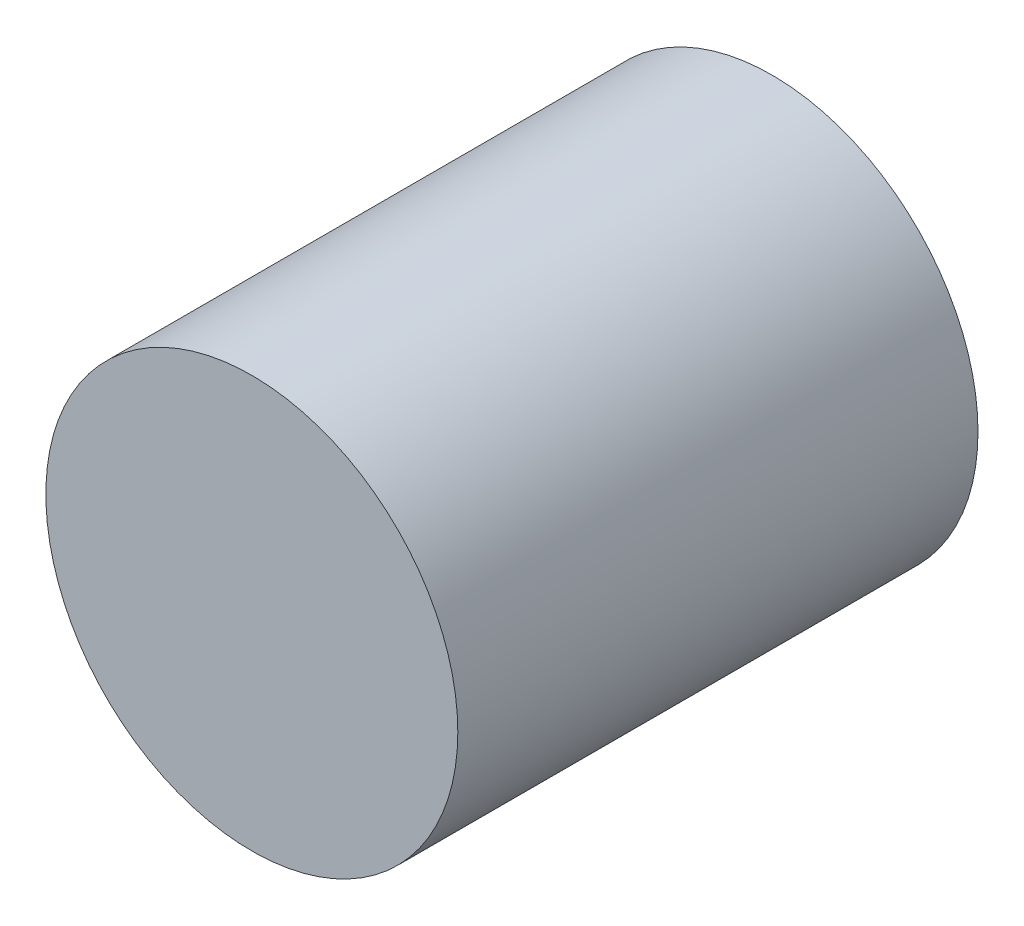
ISO-10303-21;
HEADER;
FILE_DESCRIPTION(('STEP AP214'),'2;1');
FILE_NAME('part.step','',(''),(''),'','','');
FILE_SCHEMA(('AUTOMOTIVE_DESIGN { 1 0 10303 214 1 1 1 1 }'));
ENDSEC;
DATA;
#1=APPLICATION_CONTEXT('core data for automotive mechanical design processes');
#2=APPLICATION_PROTOCOL_DEFINITION('international standard','automotive_design',2000,#1);
#3=PRODUCT_CONTEXT('',#1,'mechanical');
#4=PRODUCT('Part','Part','',(#3));
#5=PRODUCT_RELATED_PRODUCT_CATEGORY('part','',(#4));
#6=PRODUCT_DEFINITION_FORMATION('','',#4);
#7=PRODUCT_DEFINITION_CONTEXT('part definition',#1,'design');
#8=PRODUCT_DEFINITION('design','',#6,#7);
#9=PRODUCT_DEFINITION_SHAPE('','',#8);
#10=(LENGTH_UNIT() NAMED_UNIT(*) SI_UNIT(.MILLI.,.METRE.));
#11=(NAMED_UNIT(*) PLANE_ANGLE_UNIT() SI_UNIT($,.RADIAN.));
#12=(NAMED_UNIT(*) SI_UNIT($,.STERADIAN.) SOLID_ANGLE_UNIT());
#13=UNCERTAINTY_MEASURE_WITH_UNIT(LENGTH_MEASURE(1.E-05),#10,'distance_accuracy_value','');
#14=(GEOMETRIC_REPRESENTATION_CONTEXT(3) GLOBAL_UNCERTAINTY_ASSIGNED_CONTEXT((#13)) GLOBAL_UNIT_ASSIGNED_CONTEXT((#10,
#11,#12)) REPRESENTATION_CONTEXT('',''));
#15=CARTESIAN_POINT('',(0.,0.,0.));
#16=DIRECTION('',(0.,0.,1.));
#17=DIRECTION('',(1.,0.,0.));
#18=AXIS2_PLACEMENT_3D('',#15,#16,#17);
#19=CARTESIAN_POINT('',(0.,0.,20.));
#20=DIRECTION('',(0.,0.,-1.));
#21=DIRECTION('',(-1.,0.,0.));
#22=AXIS2_PLACEMENT_3D('',#19,#20,#21);
#23=CYLINDRICAL_SURFACE('',#22,7.92);
#24=CARTESIAN_POINT('',(0.,0.,20.));
#25=DIRECTION('',(0.,0.,1.));
#26=DIRECTION('',(1.,0.,0.));
#27=AXIS2_PLACEMENT_3D('',#24,#25,#26);
#28=CIRCLE('',#27,7.92);
#29=CARTESIAN_POINT('',(7.92,0.,20.));
#30=VERTEX_POINT('',#29);
#31=EDGE_CURVE('E10',#30,#30,#28,.T.);
#32=ORIENTED_EDGE('',*,*,#31,.F.);
#33=EDGE_LOOP('',(#32));
#34=FACE_BOUND('',#33,.T.);
#35=CARTESIAN_POINT('',(0.,0.,0.));
#36=DIRECTION('',(0.,0.,1.));
#37=DIRECTION('',(1.,0.,0.));
#38=AXIS2_PLACEMENT_3D('',#35,#36,#37);
#39=CIRCLE('',#38,7.92);
#40=CARTESIAN_POINT('',(7.92,0.,0.));
#41=VERTEX_POINT('',#40);
#42=EDGE_CURVE('E39',#41,#41,#39,.T.);
#43=ORIENTED_EDGE('',*,*,#42,.T.);
#44=EDGE_LOOP('',(#43));
#45=FACE_BOUND('',#44,.T.);
#46=ADVANCED_FACE('F36',(#34,#45),#23,.T.);
#47=CARTESIAN_POINT('',(0.,0.,20.));
#48=DIRECTION('',(0.,0.,1.));
#49=DIRECTION('',(1.,0.,0.));
#50=AXIS2_PLACEMENT_3D('',#47,#48,#49);
#51=PLANE('',#50);
#52=ORIENTED_EDGE('',*,*,#31,.T.);
#53=EDGE_LOOP('',(#52));
#54=FACE_BOUND('',#53,.T.);
#55=ADVANCED_FACE('F51',(#54),#51,.T.);
#56=CARTESIAN_POINT('',(0.,0.,0.));
#57=DIRECTION('',(0.,0.,1.));
#58=DIRECTION('',(1.,0.,0.));
#59=AXIS2_PLACEMENT_3D('',#56,#57,#58);
#60=PLANE('',#59);
#61=ORIENTED_EDGE('',*,*,#42,.F.);
#62=EDGE_LOOP('',(#61));
#63=FACE_BOUND('',#62,.T.);
#64=ADVANCED_FACE('F49',(#63),#60,.F.);
#65=CLOSED_SHELL('',(#46,#55,#64));
#66=MANIFOLD_SOLID_BREP('B2',#65);
#67=ADVANCED_BREP_SHAPE_REPRESENTATION('',(#18,#66),#14);
#68=SHAPE_DEFINITION_REPRESENTATION(#9,#67);
ENDSEC;
END-ISO-10303-21;
